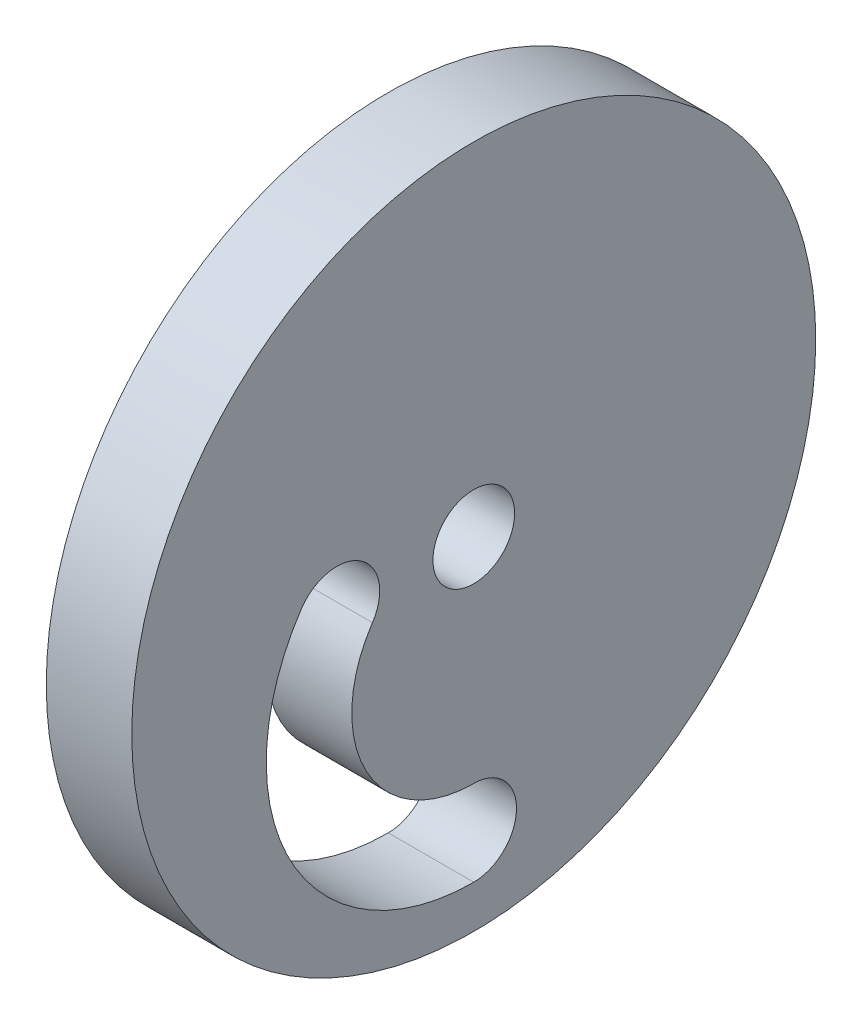
ISO-10303-21;
HEADER;
FILE_DESCRIPTION(('STEP AP214'),'2;1');
FILE_NAME('part.step','',(''),(''),'','','');
FILE_SCHEMA(('AUTOMOTIVE_DESIGN { 1 0 10303 214 1 1 1 1 }'));
ENDSEC;
DATA;
#1=APPLICATION_CONTEXT('core data for automotive mechanical design processes');
#2=APPLICATION_PROTOCOL_DEFINITION('international standard','automotive_design',2000,#1);
#3=PRODUCT_CONTEXT('',#1,'mechanical');
#4=PRODUCT('Part','Part','',(#3));
#5=PRODUCT_RELATED_PRODUCT_CATEGORY('part','',(#4));
#6=PRODUCT_DEFINITION_FORMATION('','',#4);
#7=PRODUCT_DEFINITION_CONTEXT('part definition',#1,'design');
#8=PRODUCT_DEFINITION('design','',#6,#7);
#9=PRODUCT_DEFINITION_SHAPE('','',#8);
#10=(LENGTH_UNIT() NAMED_UNIT(*) SI_UNIT(.MILLI.,.METRE.));
#11=(NAMED_UNIT(*) PLANE_ANGLE_UNIT() SI_UNIT($,.RADIAN.));
#12=(NAMED_UNIT(*) SI_UNIT($,.STERADIAN.) SOLID_ANGLE_UNIT());
#13=UNCERTAINTY_MEASURE_WITH_UNIT(LENGTH_MEASURE(1.E-05),#10,'distance_accuracy_value','');
#14=(GEOMETRIC_REPRESENTATION_CONTEXT(3) GLOBAL_UNCERTAINTY_ASSIGNED_CONTEXT((#13)) GLOBAL_UNIT_ASSIGNED_CONTEXT((#10,
#11,#12)) REPRESENTATION_CONTEXT('',''));
#15=CARTESIAN_POINT('',(0.,0.,0.));
#16=DIRECTION('',(0.,0.,1.));
#17=DIRECTION('',(1.,0.,0.));
#18=AXIS2_PLACEMENT_3D('',#15,#16,#17);
#19=CARTESIAN_POINT('',(6.35,0.,0.));
#20=DIRECTION('',(1.,0.,0.));
#21=DIRECTION('',(0.,0.,-1.));
#22=AXIS2_PLACEMENT_3D('',#19,#20,#21);
#23=PLANE('',#22);
#24=CARTESIAN_POINT('',(6.35,0.,0.));
#25=DIRECTION('',(1.,0.,0.));
#26=DIRECTION('',(0.,0.,-1.));
#27=AXIS2_PLACEMENT_3D('',#24,#25,#26);
#28=CIRCLE('',#27,25.4);
#29=CARTESIAN_POINT('',(6.35,0.,-25.4));
#30=VERTEX_POINT('',#29);
#31=EDGE_CURVE('E11',#30,#30,#28,.T.);
#32=ORIENTED_EDGE('',*,*,#31,.T.);
#33=EDGE_LOOP('',(#32));
#34=FACE_BOUND('',#33,.T.);
#35=CARTESIAN_POINT('',(6.35,0.,0.));
#36=DIRECTION('',(1.,0.,0.));
#37=DIRECTION('',(0.,0.,-1.));
#38=AXIS2_PLACEMENT_3D('',#35,#36,#37);
#39=CIRCLE('',#38,3.03143263354271);
#40=CARTESIAN_POINT('',(6.35,0.,-3.03143263354271));
#41=VERTEX_POINT('',#40);
#42=EDGE_CURVE('E110',#41,#41,#39,.T.);
#43=ORIENTED_EDGE('',*,*,#42,.F.);
#44=EDGE_LOOP('',(#43));
#45=FACE_BOUND('',#44,.T.);
#46=CARTESIAN_POINT('',(6.35,-6.81566666666664,0.));
#47=DIRECTION('',(1.,0.,0.));
#48=DIRECTION('',(0.,0.,-1.));
#49=AXIS2_PLACEMENT_3D('',#46,#47,#48);
#50=CIRCLE('',#49,15.4093333333333);
#51=CARTESIAN_POINT('',(6.35,1.76877162629758,12.7966782006921));
#52=VERTEX_POINT('',#51);
#53=CARTESIAN_POINT('',(6.35,-22.225,0.));
#54=VERTEX_POINT('',#53);
#55=EDGE_CURVE('E82',#52,#54,#50,.T.);
#56=ORIENTED_EDGE('',*,*,#55,.F.);
#57=CARTESIAN_POINT('',(6.35,0.,10.16));
#58=DIRECTION('',(1.,0.,0.));
#59=DIRECTION('',(0.,0.,-1.));
#60=AXIS2_PLACEMENT_3D('',#57,#58,#59);
#61=CIRCLE('',#60,3.175);
#62=CARTESIAN_POINT('',(6.35,-1.76877162629756,7.52332179930798));
#63=VERTEX_POINT('',#62);
#64=EDGE_CURVE('E74',#63,#52,#61,.T.);
#65=ORIENTED_EDGE('',*,*,#64,.F.);
#66=CARTESIAN_POINT('',(6.35,-6.81566666666664,0.));
#67=DIRECTION('',(-1.,0.,0.));
#68=DIRECTION('',(0.,0.,-1.));
#69=AXIS2_PLACEMENT_3D('',#66,#67,#68);
#70=CIRCLE('',#69,9.05933333333334);
#71=CARTESIAN_POINT('',(6.35,-15.875,0.));
#72=VERTEX_POINT('',#71);
#73=EDGE_CURVE('E96',#72,#63,#70,.T.);
#74=ORIENTED_EDGE('',*,*,#73,.F.);
#75=CARTESIAN_POINT('',(6.35,-19.05,0.));
#76=DIRECTION('',(1.,0.,0.));
#77=DIRECTION('',(0.,0.,-1.));
#78=AXIS2_PLACEMENT_3D('',#75,#76,#77);
#79=CIRCLE('',#78,3.175);
#80=EDGE_CURVE('E94',#54,#72,#79,.T.);
#81=ORIENTED_EDGE('',*,*,#80,.F.);
#82=EDGE_LOOP('',(#56,#65,#74,#81));
#83=FACE_BOUND('',#82,.T.);
#84=ADVANCED_FACE('F33',(#34,#45,#83),#23,.T.);
#85=CARTESIAN_POINT('',(0.,0.,0.));
#86=DIRECTION('',(1.,0.,0.));
#87=DIRECTION('',(0.,0.,-1.));
#88=AXIS2_PLACEMENT_3D('',#85,#86,#87);
#89=PLANE('',#88);
#90=CARTESIAN_POINT('',(0.,0.,0.));
#91=DIRECTION('',(1.,0.,0.));
#92=DIRECTION('',(0.,0.,-1.));
#93=AXIS2_PLACEMENT_3D('',#90,#91,#92);
#94=CIRCLE('',#93,3.03143263354271);
#95=CARTESIAN_POINT('',(0.,0.,-3.03143263354271));
#96=VERTEX_POINT('',#95);
#97=EDGE_CURVE('E90',#96,#96,#94,.T.);
#98=ORIENTED_EDGE('',*,*,#97,.T.);
#99=EDGE_LOOP('',(#98));
#100=FACE_BOUND('',#99,.T.);
#101=CARTESIAN_POINT('',(0.,0.,0.));
#102=DIRECTION('',(1.,0.,0.));
#103=DIRECTION('',(0.,0.,-1.));
#104=AXIS2_PLACEMENT_3D('',#101,#102,#103);
#105=CIRCLE('',#104,25.4);
#106=CARTESIAN_POINT('',(0.,0.,-25.4));
#107=VERTEX_POINT('',#106);
#108=EDGE_CURVE('E37',#107,#107,#105,.T.);
#109=ORIENTED_EDGE('',*,*,#108,.F.);
#110=EDGE_LOOP('',(#109));
#111=FACE_BOUND('',#110,.T.);
#112=CARTESIAN_POINT('',(0.,0.,10.16));
#113=DIRECTION('',(1.,0.,0.));
#114=DIRECTION('',(0.,0.,-1.));
#115=AXIS2_PLACEMENT_3D('',#112,#113,#114);
#116=CIRCLE('',#115,3.175);
#117=CARTESIAN_POINT('',(0.,-1.76877162629756,7.52332179930798));
#118=VERTEX_POINT('',#117);
#119=CARTESIAN_POINT('',(0.,1.76877162629758,12.7966782006921));
#120=VERTEX_POINT('',#119);
#121=EDGE_CURVE('E56',#118,#120,#116,.T.);
#122=ORIENTED_EDGE('',*,*,#121,.T.);
#123=CARTESIAN_POINT('',(0.,-6.81566666666664,0.));
#124=DIRECTION('',(1.,0.,0.));
#125=DIRECTION('',(0.,0.,-1.));
#126=AXIS2_PLACEMENT_3D('',#123,#124,#125);
#127=CIRCLE('',#126,15.4093333333333);
#128=CARTESIAN_POINT('',(0.,-22.225,0.));
#129=VERTEX_POINT('',#128);
#130=EDGE_CURVE('E89',#120,#129,#127,.T.);
#131=ORIENTED_EDGE('',*,*,#130,.T.);
#132=CARTESIAN_POINT('',(0.,-19.05,0.));
#133=DIRECTION('',(1.,0.,0.));
#134=DIRECTION('',(0.,0.,-1.));
#135=AXIS2_PLACEMENT_3D('',#132,#133,#134);
#136=CIRCLE('',#135,3.175);
#137=CARTESIAN_POINT('',(0.,-15.875,0.));
#138=VERTEX_POINT('',#137);
#139=EDGE_CURVE('E102',#129,#138,#136,.T.);
#140=ORIENTED_EDGE('',*,*,#139,.T.);
#141=CARTESIAN_POINT('',(0.,-6.81566666666664,0.));
#142=DIRECTION('',(-1.,0.,0.));
#143=DIRECTION('',(0.,0.,-1.));
#144=AXIS2_PLACEMENT_3D('',#141,#142,#143);
#145=CIRCLE('',#144,9.05933333333334);
#146=EDGE_CURVE('E83',#138,#118,#145,.T.);
#147=ORIENTED_EDGE('',*,*,#146,.T.);
#148=EDGE_LOOP('',(#122,#131,#140,#147));
#149=FACE_BOUND('',#148,.T.);
#150=ADVANCED_FACE('F116',(#100,#111,#149),#89,.F.);
#151=CARTESIAN_POINT('',(6.35,0.,0.));
#152=DIRECTION('',(-1.,0.,0.));
#153=DIRECTION('',(0.,0.,1.));
#154=AXIS2_PLACEMENT_3D('',#151,#152,#153);
#155=CYLINDRICAL_SURFACE('',#154,25.4);
#156=ORIENTED_EDGE('',*,*,#31,.F.);
#157=EDGE_LOOP('',(#156));
#158=FACE_BOUND('',#157,.T.);
#159=ORIENTED_EDGE('',*,*,#108,.T.);
#160=EDGE_LOOP('',(#159));
#161=FACE_BOUND('',#160,.T.);
#162=ADVANCED_FACE('F35',(#158,#161),#155,.T.);
#163=CARTESIAN_POINT('',(6.35,0.,0.));
#164=DIRECTION('',(-1.,0.,0.));
#165=DIRECTION('',(0.,0.,1.));
#166=AXIS2_PLACEMENT_3D('',#163,#164,#165);
#167=CYLINDRICAL_SURFACE('',#166,3.03143263354271);
#168=ORIENTED_EDGE('',*,*,#42,.T.);
#169=EDGE_LOOP('',(#168));
#170=FACE_BOUND('',#169,.T.);
#171=ORIENTED_EDGE('',*,*,#97,.F.);
#172=EDGE_LOOP('',(#171));
#173=FACE_BOUND('',#172,.T.);
#174=ADVANCED_FACE('F119',(#170,#173),#167,.F.);
#175=CARTESIAN_POINT('',(6.35,0.,10.16));
#176=DIRECTION('',(-1.,0.,0.));
#177=DIRECTION('',(0.,0.,1.));
#178=AXIS2_PLACEMENT_3D('',#175,#176,#177);
#179=CYLINDRICAL_SURFACE('',#178,3.175);
#180=ORIENTED_EDGE('',*,*,#121,.F.);
#181=DIRECTION('',(-1.,0.,0.));
#182=VECTOR('',#181,1.);
#183=CARTESIAN_POINT('',(6.35,-1.76877162629756,7.52332179930798));
#184=LINE('',#183,#182);
#185=EDGE_CURVE('E78',#63,#118,#184,.T.);
#186=ORIENTED_EDGE('',*,*,#185,.F.);
#187=ORIENTED_EDGE('',*,*,#64,.T.);
#188=DIRECTION('',(-1.,0.,0.));
#189=VECTOR('',#188,1.);
#190=CARTESIAN_POINT('',(6.35,1.76877162629758,12.7966782006921));
#191=LINE('',#190,#189);
#192=EDGE_CURVE('E77',#52,#120,#191,.T.);
#193=ORIENTED_EDGE('',*,*,#192,.T.);
#194=EDGE_LOOP('',(#180,#186,#187,#193));
#195=FACE_BOUND('',#194,.T.);
#196=ADVANCED_FACE('F76',(#195),#179,.F.);
#197=CARTESIAN_POINT('',(6.35,-6.81566666666664,0.));
#198=DIRECTION('',(-1.,0.,0.));
#199=DIRECTION('',(0.,0.,1.));
#200=AXIS2_PLACEMENT_3D('',#197,#198,#199);
#201=CYLINDRICAL_SURFACE('',#200,15.4093333333333);
#202=ORIENTED_EDGE('',*,*,#130,.F.);
#203=ORIENTED_EDGE('',*,*,#192,.F.);
#204=ORIENTED_EDGE('',*,*,#55,.T.);
#205=DIRECTION('',(-1.,0.,0.));
#206=VECTOR('',#205,1.);
#207=CARTESIAN_POINT('',(6.35,-22.225,0.));
#208=LINE('',#207,#206);
#209=EDGE_CURVE('E91',#54,#129,#208,.T.);
#210=ORIENTED_EDGE('',*,*,#209,.T.);
#211=EDGE_LOOP('',(#202,#203,#204,#210));
#212=FACE_BOUND('',#211,.T.);
#213=ADVANCED_FACE('F86',(#212),#201,.F.);
#214=CARTESIAN_POINT('',(6.35,-19.05,0.));
#215=DIRECTION('',(-1.,0.,0.));
#216=DIRECTION('',(0.,0.,1.));
#217=AXIS2_PLACEMENT_3D('',#214,#215,#216);
#218=CYLINDRICAL_SURFACE('',#217,3.175);
#219=ORIENTED_EDGE('',*,*,#139,.F.);
#220=ORIENTED_EDGE('',*,*,#209,.F.);
#221=ORIENTED_EDGE('',*,*,#80,.T.);
#222=DIRECTION('',(-1.,0.,0.));
#223=VECTOR('',#222,1.);
#224=CARTESIAN_POINT('',(6.35,-15.875,0.));
#225=LINE('',#224,#223);
#226=EDGE_CURVE('E48',#72,#138,#225,.T.);
#227=ORIENTED_EDGE('',*,*,#226,.T.);
#228=EDGE_LOOP('',(#219,#220,#221,#227));
#229=FACE_BOUND('',#228,.T.);
#230=ADVANCED_FACE('F145',(#229),#218,.F.);
#231=CARTESIAN_POINT('',(6.35,-6.81566666666664,0.));
#232=DIRECTION('',(-1.,0.,0.));
#233=DIRECTION('',(0.,0.,1.));
#234=AXIS2_PLACEMENT_3D('',#231,#232,#233);
#235=CYLINDRICAL_SURFACE('',#234,9.05933333333334);
#236=ORIENTED_EDGE('',*,*,#146,.F.);
#237=ORIENTED_EDGE('',*,*,#226,.F.);
#238=ORIENTED_EDGE('',*,*,#73,.T.);
#239=ORIENTED_EDGE('',*,*,#185,.T.);
#240=EDGE_LOOP('',(#236,#237,#238,#239));
#241=FACE_BOUND('',#240,.T.);
#242=ADVANCED_FACE('F143',(#241),#235,.T.);
#243=CLOSED_SHELL('',(#84,#150,#162,#174,#196,#213,#230,#242));
#244=MANIFOLD_SOLID_BREP('B2',#243);
#245=ADVANCED_BREP_SHAPE_REPRESENTATION('',(#18,#244),#14);
#246=SHAPE_DEFINITION_REPRESENTATION(#9,#245);
ENDSEC;
END-ISO-10303-21;
